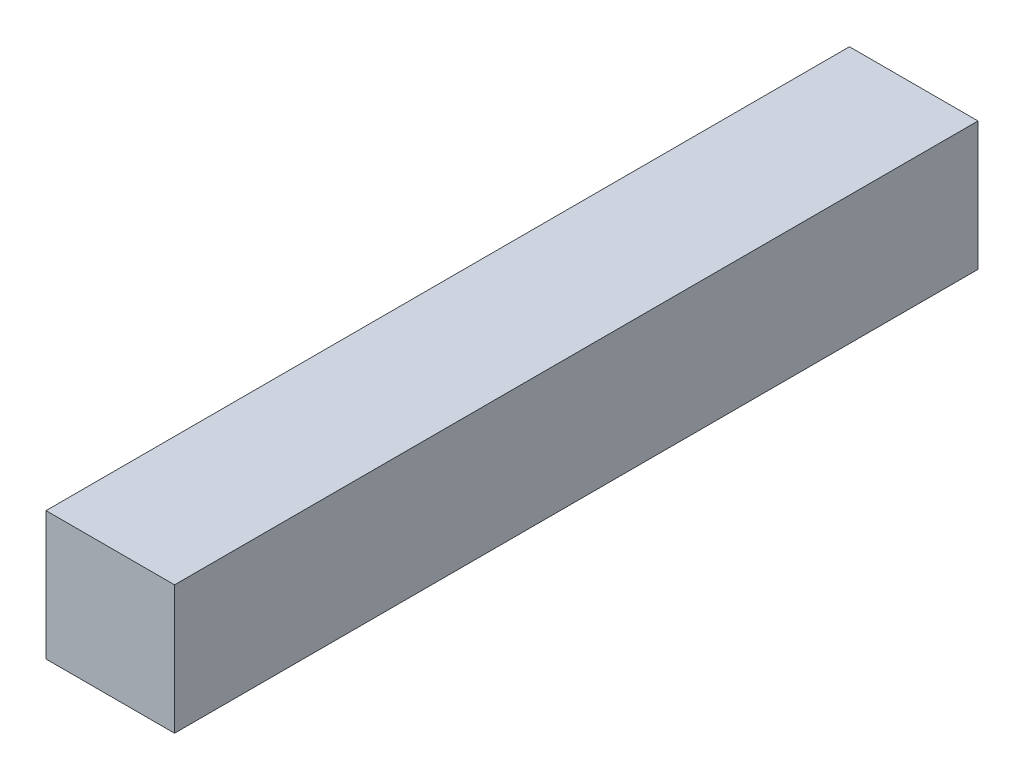
ISO-10303-21;
HEADER;
FILE_DESCRIPTION(('STEP AP214'),'2;1');
FILE_NAME('part.step','',(''),(''),'','','');
FILE_SCHEMA(('AUTOMOTIVE_DESIGN { 1 0 10303 214 1 1 1 1 }'));
ENDSEC;
DATA;
#1=APPLICATION_CONTEXT('core data for automotive mechanical design processes');
#2=APPLICATION_PROTOCOL_DEFINITION('international standard','automotive_design',2000,#1);
#3=PRODUCT_CONTEXT('',#1,'mechanical');
#4=PRODUCT('Part','Part','',(#3));
#5=PRODUCT_RELATED_PRODUCT_CATEGORY('part','',(#4));
#6=PRODUCT_DEFINITION_FORMATION('','',#4);
#7=PRODUCT_DEFINITION_CONTEXT('part definition',#1,'design');
#8=PRODUCT_DEFINITION('design','',#6,#7);
#9=PRODUCT_DEFINITION_SHAPE('','',#8);
#10=(LENGTH_UNIT() NAMED_UNIT(*) SI_UNIT(.MILLI.,.METRE.));
#11=(NAMED_UNIT(*) PLANE_ANGLE_UNIT() SI_UNIT($,.RADIAN.));
#12=(NAMED_UNIT(*) SI_UNIT($,.STERADIAN.) SOLID_ANGLE_UNIT());
#13=UNCERTAINTY_MEASURE_WITH_UNIT(LENGTH_MEASURE(1.E-05),#10,'distance_accuracy_value','');
#14=(GEOMETRIC_REPRESENTATION_CONTEXT(3) GLOBAL_UNCERTAINTY_ASSIGNED_CONTEXT((#13)) GLOBAL_UNIT_ASSIGNED_CONTEXT((#10,
#11,#12)) REPRESENTATION_CONTEXT('',''));
#15=CARTESIAN_POINT('',(0.,0.,0.));
#16=DIRECTION('',(0.,0.,1.));
#17=DIRECTION('',(1.,0.,0.));
#18=AXIS2_PLACEMENT_3D('',#15,#16,#17);
#19=CARTESIAN_POINT('',(-1.,2.,6.25));
#20=DIRECTION('',(1.,0.,0.));
#21=DIRECTION('',(0.,0.,-1.));
#22=AXIS2_PLACEMENT_3D('',#19,#20,#21);
#23=PLANE('',#22);
#24=DIRECTION('',(0.,0.,1.));
#25=VECTOR('',#24,1.);
#26=CARTESIAN_POINT('',(-1.,0.,6.25));
#27=LINE('',#26,#25);
#28=CARTESIAN_POINT('',(-1.,0.,-6.25));
#29=VERTEX_POINT('',#28);
#30=CARTESIAN_POINT('',(-1.,0.,6.25));
#31=VERTEX_POINT('',#30);
#32=EDGE_CURVE('E95',#29,#31,#27,.T.);
#33=ORIENTED_EDGE('',*,*,#32,.T.);
#34=DIRECTION('',(0.,-1.,0.));
#35=VECTOR('',#34,1.);
#36=CARTESIAN_POINT('',(-1.,2.,6.25));
#37=LINE('',#36,#35);
#38=CARTESIAN_POINT('',(-1.,2.,6.25));
#39=VERTEX_POINT('',#38);
#40=EDGE_CURVE('E11',#39,#31,#37,.T.);
#41=ORIENTED_EDGE('',*,*,#40,.F.);
#42=DIRECTION('',(0.,0.,1.));
#43=VECTOR('',#42,1.);
#44=CARTESIAN_POINT('',(-1.,2.,6.25));
#45=LINE('',#44,#43);
#46=CARTESIAN_POINT('',(-1.,2.,-6.25));
#47=VERTEX_POINT('',#46);
#48=EDGE_CURVE('E83',#47,#39,#45,.T.);
#49=ORIENTED_EDGE('',*,*,#48,.F.);
#50=DIRECTION('',(0.,-1.,0.));
#51=VECTOR('',#50,1.);
#52=CARTESIAN_POINT('',(-1.,2.,-6.25));
#53=LINE('',#52,#51);
#54=EDGE_CURVE('E91',#47,#29,#53,.T.);
#55=ORIENTED_EDGE('',*,*,#54,.T.);
#56=EDGE_LOOP('',(#33,#41,#49,#55));
#57=FACE_BOUND('',#56,.T.);
#58=ADVANCED_FACE('F32',(#57),#23,.F.);
#59=CARTESIAN_POINT('',(1.,2.,6.25));
#60=DIRECTION('',(0.,0.,-1.));
#61=DIRECTION('',(-1.,0.,0.));
#62=AXIS2_PLACEMENT_3D('',#59,#60,#61);
#63=PLANE('',#62);
#64=DIRECTION('',(1.,0.,0.));
#65=VECTOR('',#64,1.);
#66=CARTESIAN_POINT('',(1.,0.,6.25));
#67=LINE('',#66,#65);
#68=CARTESIAN_POINT('',(1.,0.,6.25));
#69=VERTEX_POINT('',#68);
#70=EDGE_CURVE('E87',#31,#69,#67,.T.);
#71=ORIENTED_EDGE('',*,*,#70,.T.);
#72=DIRECTION('',(0.,-1.,0.));
#73=VECTOR('',#72,1.);
#74=CARTESIAN_POINT('',(1.,2.,6.25));
#75=LINE('',#74,#73);
#76=CARTESIAN_POINT('',(1.,2.,6.25));
#77=VERTEX_POINT('',#76);
#78=EDGE_CURVE('E40',#77,#69,#75,.T.);
#79=ORIENTED_EDGE('',*,*,#78,.F.);
#80=DIRECTION('',(1.,0.,0.));
#81=VECTOR('',#80,1.);
#82=CARTESIAN_POINT('',(1.,2.,6.25));
#83=LINE('',#82,#81);
#84=EDGE_CURVE('E78',#39,#77,#83,.T.);
#85=ORIENTED_EDGE('',*,*,#84,.F.);
#86=ORIENTED_EDGE('',*,*,#40,.T.);
#87=EDGE_LOOP('',(#71,#79,#85,#86));
#88=FACE_BOUND('',#87,.T.);
#89=ADVANCED_FACE('F86',(#88),#63,.F.);
#90=CARTESIAN_POINT('',(1.,2.,6.25));
#91=DIRECTION('',(-1.,0.,0.));
#92=DIRECTION('',(0.,0.,1.));
#93=AXIS2_PLACEMENT_3D('',#90,#91,#92);
#94=PLANE('',#93);
#95=DIRECTION('',(0.,0.,-1.));
#96=VECTOR('',#95,1.);
#97=CARTESIAN_POINT('',(1.,0.,6.25));
#98=LINE('',#97,#96);
#99=CARTESIAN_POINT('',(1.,0.,-6.25));
#100=VERTEX_POINT('',#99);
#101=EDGE_CURVE('E65',#69,#100,#98,.T.);
#102=ORIENTED_EDGE('',*,*,#101,.T.);
#103=DIRECTION('',(0.,-1.,0.));
#104=VECTOR('',#103,1.);
#105=CARTESIAN_POINT('',(1.,2.,-6.25));
#106=LINE('',#105,#104);
#107=CARTESIAN_POINT('',(1.,2.,-6.25));
#108=VERTEX_POINT('',#107);
#109=EDGE_CURVE('E88',#108,#100,#106,.T.);
#110=ORIENTED_EDGE('',*,*,#109,.F.);
#111=DIRECTION('',(0.,0.,-1.));
#112=VECTOR('',#111,1.);
#113=CARTESIAN_POINT('',(1.,2.,6.25));
#114=LINE('',#113,#112);
#115=EDGE_CURVE('E81',#77,#108,#114,.T.);
#116=ORIENTED_EDGE('',*,*,#115,.F.);
#117=ORIENTED_EDGE('',*,*,#78,.T.);
#118=EDGE_LOOP('',(#102,#110,#116,#117));
#119=FACE_BOUND('',#118,.T.);
#120=ADVANCED_FACE('F89',(#119),#94,.F.);
#121=CARTESIAN_POINT('',(1.,2.,-6.25));
#122=DIRECTION('',(0.,0.,1.));
#123=DIRECTION('',(1.,0.,0.));
#124=AXIS2_PLACEMENT_3D('',#121,#122,#123);
#125=PLANE('',#124);
#126=DIRECTION('',(-1.,0.,0.));
#127=VECTOR('',#126,1.);
#128=CARTESIAN_POINT('',(1.,0.,-6.25));
#129=LINE('',#128,#127);
#130=EDGE_CURVE('E71',#100,#29,#129,.T.);
#131=ORIENTED_EDGE('',*,*,#130,.T.);
#132=ORIENTED_EDGE('',*,*,#54,.F.);
#133=DIRECTION('',(-1.,0.,0.));
#134=VECTOR('',#133,1.);
#135=CARTESIAN_POINT('',(1.,2.,-6.25));
#136=LINE('',#135,#134);
#137=EDGE_CURVE('E48',#108,#47,#136,.T.);
#138=ORIENTED_EDGE('',*,*,#137,.F.);
#139=ORIENTED_EDGE('',*,*,#109,.T.);
#140=EDGE_LOOP('',(#131,#132,#138,#139));
#141=FACE_BOUND('',#140,.T.);
#142=ADVANCED_FACE('F102',(#141),#125,.F.);
#143=CARTESIAN_POINT('',(0.,2.,0.));
#144=DIRECTION('',(0.,1.,0.));
#145=DIRECTION('',(0.,0.,1.));
#146=AXIS2_PLACEMENT_3D('',#143,#144,#145);
#147=PLANE('',#146);
#148=ORIENTED_EDGE('',*,*,#48,.T.);
#149=ORIENTED_EDGE('',*,*,#84,.T.);
#150=ORIENTED_EDGE('',*,*,#115,.T.);
#151=ORIENTED_EDGE('',*,*,#137,.T.);
#152=EDGE_LOOP('',(#148,#149,#150,#151));
#153=FACE_BOUND('',#152,.T.);
#154=ADVANCED_FACE('F79',(#153),#147,.T.);
#155=CARTESIAN_POINT('',(0.,0.,0.));
#156=DIRECTION('',(0.,1.,0.));
#157=DIRECTION('',(0.,0.,1.));
#158=AXIS2_PLACEMENT_3D('',#155,#156,#157);
#159=PLANE('',#158);
#160=ORIENTED_EDGE('',*,*,#32,.F.);
#161=ORIENTED_EDGE('',*,*,#130,.F.);
#162=ORIENTED_EDGE('',*,*,#101,.F.);
#163=ORIENTED_EDGE('',*,*,#70,.F.);
#164=EDGE_LOOP('',(#160,#161,#162,#163));
#165=FACE_BOUND('',#164,.T.);
#166=ADVANCED_FACE('F105',(#165),#159,.F.);
#167=CLOSED_SHELL('',(#58,#89,#120,#142,#154,#166));
#168=MANIFOLD_SOLID_BREP('B2',#167);
#169=ADVANCED_BREP_SHAPE_REPRESENTATION('',(#18,#168),#14);
#170=SHAPE_DEFINITION_REPRESENTATION(#9,#169);
ENDSEC;
END-ISO-10303-21;
